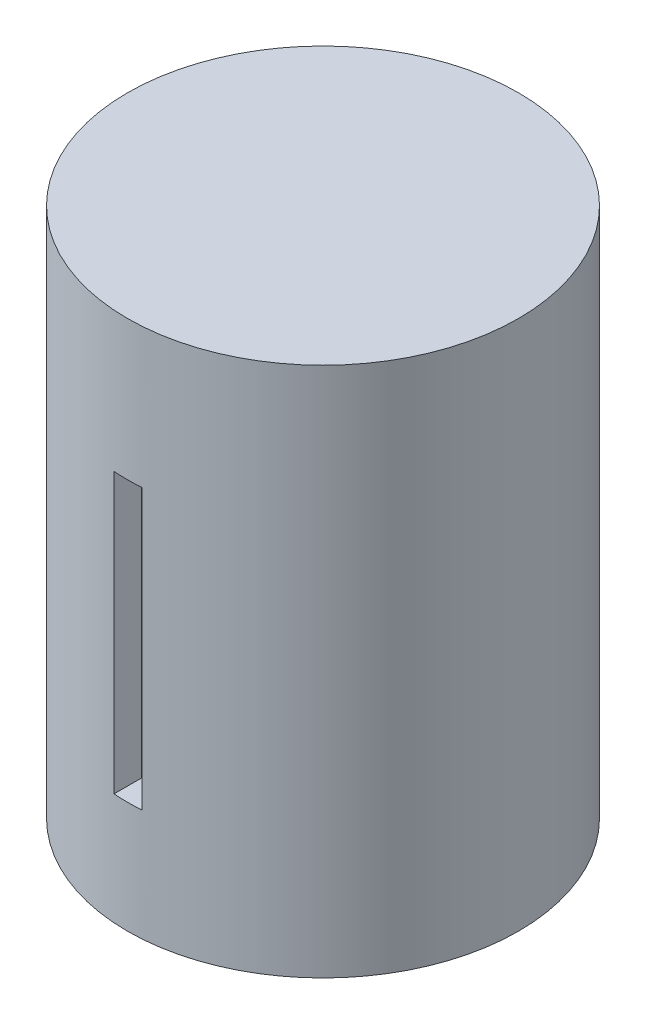
ISO-10303-21;
HEADER;
FILE_DESCRIPTION(('STEP AP214'),'2;1');
FILE_NAME('part.step','',(''),(''),'','','');
FILE_SCHEMA(('AUTOMOTIVE_DESIGN { 1 0 10303 214 1 1 1 1 }'));
ENDSEC;
DATA;
#1=APPLICATION_CONTEXT('core data for automotive mechanical design processes');
#2=APPLICATION_PROTOCOL_DEFINITION('international standard','automotive_design',2000,#1);
#3=PRODUCT_CONTEXT('',#1,'mechanical');
#4=PRODUCT('Part','Part','',(#3));
#5=PRODUCT_RELATED_PRODUCT_CATEGORY('part','',(#4));
#6=PRODUCT_DEFINITION_FORMATION('','',#4);
#7=PRODUCT_DEFINITION_CONTEXT('part definition',#1,'design');
#8=PRODUCT_DEFINITION('design','',#6,#7);
#9=PRODUCT_DEFINITION_SHAPE('','',#8);
#10=(LENGTH_UNIT() NAMED_UNIT(*) SI_UNIT(.MILLI.,.METRE.));
#11=(NAMED_UNIT(*) PLANE_ANGLE_UNIT() SI_UNIT($,.RADIAN.));
#12=(NAMED_UNIT(*) SI_UNIT($,.STERADIAN.) SOLID_ANGLE_UNIT());
#13=UNCERTAINTY_MEASURE_WITH_UNIT(LENGTH_MEASURE(1.E-05),#10,'distance_accuracy_value','');
#14=(GEOMETRIC_REPRESENTATION_CONTEXT(3) GLOBAL_UNCERTAINTY_ASSIGNED_CONTEXT((#13)) GLOBAL_UNIT_ASSIGNED_CONTEXT((#10,
#11,#12)) REPRESENTATION_CONTEXT('',''));
#15=CARTESIAN_POINT('',(0.,0.,0.));
#16=DIRECTION('',(0.,0.,1.));
#17=DIRECTION('',(1.,0.,0.));
#18=AXIS2_PLACEMENT_3D('',#15,#16,#17);
#19=CARTESIAN_POINT('',(0.,38.,0.));
#20=DIRECTION('',(0.,-1.,0.));
#21=DIRECTION('',(0.,0.,-1.));
#22=AXIS2_PLACEMENT_3D('',#19,#20,#21);
#23=CYLINDRICAL_SURFACE('',#22,14.);
#24=CARTESIAN_POINT('',(0.,0.,0.));
#25=DIRECTION('',(0.,1.,0.));
#26=DIRECTION('',(0.,0.,1.));
#27=AXIS2_PLACEMENT_3D('',#24,#25,#26);
#28=CIRCLE('',#27,14.);
#29=CARTESIAN_POINT('',(0.,0.,14.));
#30=VERTEX_POINT('',#29);
#31=EDGE_CURVE('E95',#30,#30,#28,.T.);
#32=ORIENTED_EDGE('',*,*,#31,.T.);
#33=EDGE_LOOP('',(#32));
#34=FACE_BOUND('',#33,.T.);
#35=CARTESIAN_POINT('',(0.,38.,0.));
#36=DIRECTION('',(0.,1.,0.));
#37=DIRECTION('',(0.,0.,1.));
#38=AXIS2_PLACEMENT_3D('',#35,#36,#37);
#39=CIRCLE('',#38,14.);
#40=CARTESIAN_POINT('',(0.,38.,14.));
#41=VERTEX_POINT('',#40);
#42=EDGE_CURVE('E109',#41,#41,#39,.T.);
#43=ORIENTED_EDGE('',*,*,#42,.F.);
#44=EDGE_LOOP('',(#43));
#45=FACE_BOUND('',#44,.T.);
#46=CARTESIAN_POINT('',(0.,28.,0.));
#47=DIRECTION('',(0.,-1.,0.));
#48=DIRECTION('',(0.,0.,-1.));
#49=AXIS2_PLACEMENT_3D('',#46,#47,#48);
#50=CIRCLE('',#49,14.);
#51=CARTESIAN_POINT('',(1.,28.,13.9642400437689));
#52=VERTEX_POINT('',#51);
#53=CARTESIAN_POINT('',(-1.,28.,13.9642400437689));
#54=VERTEX_POINT('',#53);
#55=EDGE_CURVE('E11',#52,#54,#50,.T.);
#56=ORIENTED_EDGE('',*,*,#55,.F.);
#57=DIRECTION('',(0.,-1.,0.));
#58=VECTOR('',#57,1.);
#59=CARTESIAN_POINT('',(1.,38.,13.9642400437689));
#60=LINE('',#59,#58);
#61=CARTESIAN_POINT('',(1.,8.,13.9642400437689));
#62=VERTEX_POINT('',#61);
#63=EDGE_CURVE('E63',#62,#52,#60,.F.);
#64=ORIENTED_EDGE('',*,*,#63,.F.);
#65=CARTESIAN_POINT('',(0.,8.,0.));
#66=DIRECTION('',(0.,-1.,0.));
#67=DIRECTION('',(0.,0.,-1.));
#68=AXIS2_PLACEMENT_3D('',#65,#66,#67);
#69=CIRCLE('',#68,14.);
#70=CARTESIAN_POINT('',(-1.,8.,13.9642400437689));
#71=VERTEX_POINT('',#70);
#72=EDGE_CURVE('E112',#62,#71,#69,.T.);
#73=ORIENTED_EDGE('',*,*,#72,.T.);
#74=DIRECTION('',(0.,-1.,0.));
#75=VECTOR('',#74,1.);
#76=CARTESIAN_POINT('',(-1.,38.,13.9642400437689));
#77=LINE('',#76,#75);
#78=EDGE_CURVE('E48',#54,#71,#77,.T.);
#79=ORIENTED_EDGE('',*,*,#78,.F.);
#80=EDGE_LOOP('',(#56,#64,#73,#79));
#81=FACE_BOUND('',#80,.T.);
#82=ADVANCED_FACE('F41',(#34,#45,#81),#23,.T.);
#83=CARTESIAN_POINT('',(0.,38.,0.));
#84=DIRECTION('',(0.,1.,0.));
#85=DIRECTION('',(0.,0.,1.));
#86=AXIS2_PLACEMENT_3D('',#83,#84,#85);
#87=PLANE('',#86);
#88=ORIENTED_EDGE('',*,*,#42,.T.);
#89=EDGE_LOOP('',(#88));
#90=FACE_BOUND('',#89,.T.);
#91=ADVANCED_FACE('F131',(#90),#87,.T.);
#92=CARTESIAN_POINT('',(0.,0.,0.));
#93=DIRECTION('',(0.,1.,0.));
#94=DIRECTION('',(0.,0.,1.));
#95=AXIS2_PLACEMENT_3D('',#92,#93,#94);
#96=PLANE('',#95);
#97=ORIENTED_EDGE('',*,*,#31,.F.);
#98=EDGE_LOOP('',(#97));
#99=FACE_BOUND('',#98,.T.);
#100=ADVANCED_FACE('F136',(#99),#96,.F.);
#101=CARTESIAN_POINT('',(-1.,28.,15.));
#102=DIRECTION('',(1.,0.,0.));
#103=DIRECTION('',(0.,0.,-1.));
#104=AXIS2_PLACEMENT_3D('',#101,#102,#103);
#105=PLANE('',#104);
#106=ORIENTED_EDGE('',*,*,#78,.T.);
#107=DIRECTION('',(0.,0.,1.));
#108=VECTOR('',#107,1.);
#109=CARTESIAN_POINT('',(-1.,8.,15.));
#110=LINE('',#109,#108);
#111=CARTESIAN_POINT('',(-1.,8.,12.));
#112=VERTEX_POINT('',#111);
#113=EDGE_CURVE('E55',#112,#71,#110,.T.);
#114=ORIENTED_EDGE('',*,*,#113,.F.);
#115=DIRECTION('',(0.,-1.,0.));
#116=VECTOR('',#115,1.);
#117=CARTESIAN_POINT('',(-1.,28.,12.));
#118=LINE('',#117,#116);
#119=CARTESIAN_POINT('',(-1.,28.,12.));
#120=VERTEX_POINT('',#119);
#121=EDGE_CURVE('E96',#120,#112,#118,.T.);
#122=ORIENTED_EDGE('',*,*,#121,.F.);
#123=DIRECTION('',(0.,0.,1.));
#124=VECTOR('',#123,1.);
#125=CARTESIAN_POINT('',(-1.,28.,15.));
#126=LINE('',#125,#124);
#127=EDGE_CURVE('E88',#120,#54,#126,.T.);
#128=ORIENTED_EDGE('',*,*,#127,.T.);
#129=EDGE_LOOP('',(#106,#114,#122,#128));
#130=FACE_BOUND('',#129,.T.);
#131=ADVANCED_FACE('F119',(#130),#105,.T.);
#132=CARTESIAN_POINT('',(1.,28.,15.));
#133=DIRECTION('',(-1.,0.,0.));
#134=DIRECTION('',(0.,0.,1.));
#135=AXIS2_PLACEMENT_3D('',#132,#133,#134);
#136=PLANE('',#135);
#137=ORIENTED_EDGE('',*,*,#63,.T.);
#138=DIRECTION('',(0.,0.,-1.));
#139=VECTOR('',#138,1.);
#140=CARTESIAN_POINT('',(1.,28.,15.));
#141=LINE('',#140,#139);
#142=CARTESIAN_POINT('',(1.,28.,12.));
#143=VERTEX_POINT('',#142);
#144=EDGE_CURVE('E79',#52,#143,#141,.T.);
#145=ORIENTED_EDGE('',*,*,#144,.T.);
#146=DIRECTION('',(0.,-1.,0.));
#147=VECTOR('',#146,1.);
#148=CARTESIAN_POINT('',(1.,28.,12.));
#149=LINE('',#148,#147);
#150=CARTESIAN_POINT('',(1.,8.,12.));
#151=VERTEX_POINT('',#150);
#152=EDGE_CURVE('E82',#143,#151,#149,.T.);
#153=ORIENTED_EDGE('',*,*,#152,.T.);
#154=DIRECTION('',(0.,0.,-1.));
#155=VECTOR('',#154,1.);
#156=CARTESIAN_POINT('',(1.,8.,15.));
#157=LINE('',#156,#155);
#158=EDGE_CURVE('E106',#62,#151,#157,.T.);
#159=ORIENTED_EDGE('',*,*,#158,.F.);
#160=EDGE_LOOP('',(#137,#145,#153,#159));
#161=FACE_BOUND('',#160,.T.);
#162=ADVANCED_FACE('F81',(#161),#136,.T.);
#163=CARTESIAN_POINT('',(0.,28.,0.));
#164=DIRECTION('',(0.,-1.,0.));
#165=DIRECTION('',(0.,0.,-1.));
#166=AXIS2_PLACEMENT_3D('',#163,#164,#165);
#167=PLANE('',#166);
#168=ORIENTED_EDGE('',*,*,#55,.T.);
#169=ORIENTED_EDGE('',*,*,#127,.F.);
#170=DIRECTION('',(-1.,0.,0.));
#171=VECTOR('',#170,1.);
#172=CARTESIAN_POINT('',(-1.,28.,12.));
#173=LINE('',#172,#171);
#174=EDGE_CURVE('E87',#143,#120,#173,.T.);
#175=ORIENTED_EDGE('',*,*,#174,.F.);
#176=ORIENTED_EDGE('',*,*,#144,.F.);
#177=EDGE_LOOP('',(#168,#169,#175,#176));
#178=FACE_BOUND('',#177,.T.);
#179=ADVANCED_FACE('F99',(#178),#167,.T.);
#180=CARTESIAN_POINT('',(0.,8.,0.));
#181=DIRECTION('',(0.,-1.,0.));
#182=DIRECTION('',(0.,0.,-1.));
#183=AXIS2_PLACEMENT_3D('',#180,#181,#182);
#184=PLANE('',#183);
#185=ORIENTED_EDGE('',*,*,#158,.T.);
#186=DIRECTION('',(-1.,0.,0.));
#187=VECTOR('',#186,1.);
#188=CARTESIAN_POINT('',(-1.,8.,12.));
#189=LINE('',#188,#187);
#190=EDGE_CURVE('E94',#151,#112,#189,.T.);
#191=ORIENTED_EDGE('',*,*,#190,.T.);
#192=ORIENTED_EDGE('',*,*,#113,.T.);
#193=ORIENTED_EDGE('',*,*,#72,.F.);
#194=EDGE_LOOP('',(#185,#191,#192,#193));
#195=FACE_BOUND('',#194,.T.);
#196=ADVANCED_FACE('F121',(#195),#184,.F.);
#197=CARTESIAN_POINT('',(-1.,28.,12.));
#198=DIRECTION('',(0.,0.,1.));
#199=DIRECTION('',(1.,0.,0.));
#200=AXIS2_PLACEMENT_3D('',#197,#198,#199);
#201=PLANE('',#200);
#202=ORIENTED_EDGE('',*,*,#190,.F.);
#203=ORIENTED_EDGE('',*,*,#152,.F.);
#204=ORIENTED_EDGE('',*,*,#174,.T.);
#205=ORIENTED_EDGE('',*,*,#121,.T.);
#206=EDGE_LOOP('',(#202,#203,#204,#205));
#207=FACE_BOUND('',#206,.T.);
#208=ADVANCED_FACE('F91',(#207),#201,.T.);
#209=CLOSED_SHELL('',(#82,#91,#100,#131,#162,#179,#196,#208));
#210=MANIFOLD_SOLID_BREP('B2',#209);
#211=ADVANCED_BREP_SHAPE_REPRESENTATION('',(#18,#210),#14);
#212=SHAPE_DEFINITION_REPRESENTATION(#9,#211);
ENDSEC;
END-ISO-10303-21;
